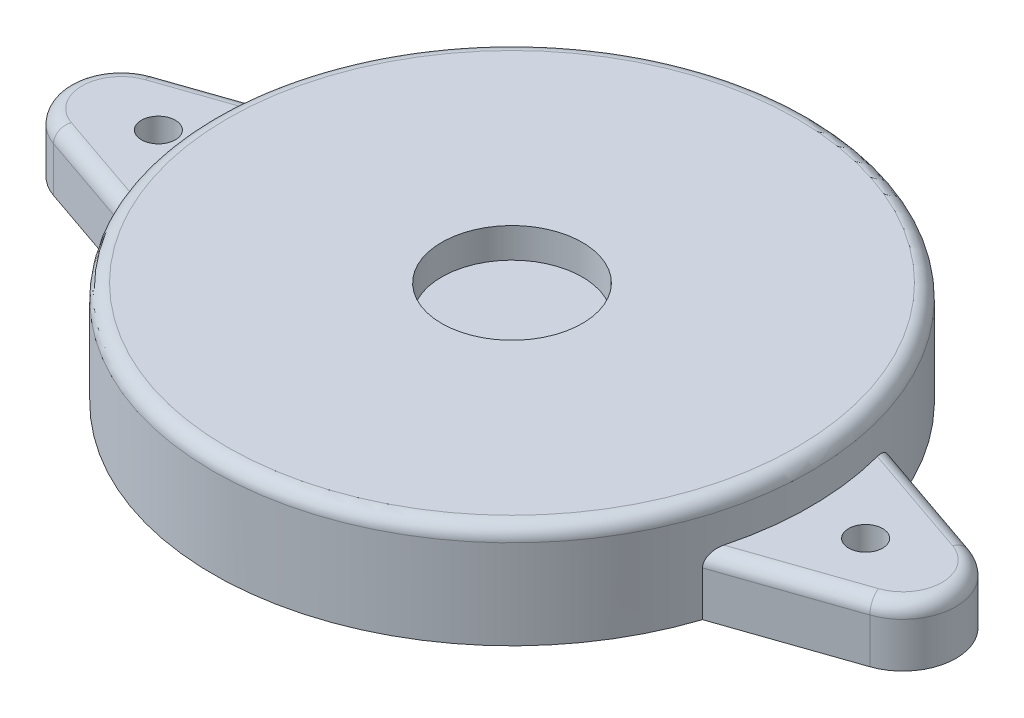
ISO-10303-21;
HEADER;
FILE_DESCRIPTION(('STEP AP214'),'2;1');
FILE_NAME('part.step','',(''),(''),'','','');
FILE_SCHEMA(('AUTOMOTIVE_DESIGN { 1 0 10303 214 1 1 1 1 }'));
ENDSEC;
DATA;
#1=APPLICATION_CONTEXT('core data for automotive mechanical design processes');
#2=APPLICATION_PROTOCOL_DEFINITION('international standard','automotive_design',2000,#1);
#3=PRODUCT_CONTEXT('',#1,'mechanical');
#4=PRODUCT('Part','Part','',(#3));
#5=PRODUCT_RELATED_PRODUCT_CATEGORY('part','',(#4));
#6=PRODUCT_DEFINITION_FORMATION('','',#4);
#7=PRODUCT_DEFINITION_CONTEXT('part definition',#1,'design');
#8=PRODUCT_DEFINITION('design','',#6,#7);
#9=PRODUCT_DEFINITION_SHAPE('','',#8);
#10=(LENGTH_UNIT() NAMED_UNIT(*) SI_UNIT(.MILLI.,.METRE.));
#11=(NAMED_UNIT(*) PLANE_ANGLE_UNIT() SI_UNIT($,.RADIAN.));
#12=(NAMED_UNIT(*) SI_UNIT($,.STERADIAN.) SOLID_ANGLE_UNIT());
#13=UNCERTAINTY_MEASURE_WITH_UNIT(LENGTH_MEASURE(1.E-05),#10,'distance_accuracy_value','');
#14=(GEOMETRIC_REPRESENTATION_CONTEXT(3) GLOBAL_UNCERTAINTY_ASSIGNED_CONTEXT((#13)) GLOBAL_UNIT_ASSIGNED_CONTEXT((#10,
#11,#12)) REPRESENTATION_CONTEXT('',''));
#15=CARTESIAN_POINT('',(0.,0.,0.));
#16=DIRECTION('',(0.,0.,1.));
#17=DIRECTION('',(1.,0.,0.));
#18=AXIS2_PLACEMENT_3D('',#15,#16,#17);
#19=CARTESIAN_POINT('',(0.,5.16,0.));
#20=DIRECTION('',(0.,-1.,0.));
#21=DIRECTION('',(0.,0.,-1.));
#22=AXIS2_PLACEMENT_3D('',#19,#20,#21);
#23=CYLINDRICAL_SURFACE('',#22,14.93);
#24=CARTESIAN_POINT('',(0.,4.46,0.));
#25=DIRECTION('',(0.,1.,0.));
#26=DIRECTION('',(0.,0.,1.));
#27=AXIS2_PLACEMENT_3D('',#24,#25,#26);
#28=CIRCLE('',#27,14.93);
#29=CARTESIAN_POINT('',(0.,4.46,14.93));
#30=VERTEX_POINT('',#29);
#31=EDGE_CURVE('E198',#30,#30,#28,.F.);
#32=ORIENTED_EDGE('',*,*,#31,.T.);
#33=EDGE_LOOP('',(#32));
#34=FACE_BOUND('',#33,.T.);
#35=CARTESIAN_POINT('',(0.,2.94,0.));
#36=DIRECTION('',(0.,-1.,0.));
#37=DIRECTION('',(0.,0.,-1.));
#38=AXIS2_PLACEMENT_3D('',#35,#36,#37);
#39=CIRCLE('',#38,14.93);
#40=CARTESIAN_POINT('',(-14.429087598297,2.94,3.8348834507287));
#41=VERTEX_POINT('',#40);
#42=CARTESIAN_POINT('',(-14.429087598297,2.94,-3.8348834507287));
#43=VERTEX_POINT('',#42);
#44=EDGE_CURVE('E159',#41,#43,#39,.T.);
#45=ORIENTED_EDGE('',*,*,#44,.F.);
#46=CARTESIAN_POINT('',(-14.429087598297,2.94,3.8348834507287));
#47=CARTESIAN_POINT('',(-14.4138774173166,2.93997814055828,3.8921743099573));
#48=CARTESIAN_POINT('',(-14.3982845537592,2.93480887956589,3.94941011262203));
#49=CARTESIAN_POINT('',(-14.3667965768096,2.91417210982097,4.06243771924972));
#50=CARTESIAN_POINT('',(-14.3509000239146,2.89861824672489,4.11821330467232));
#51=CARTESIAN_POINT('',(-14.3202531008862,2.85814754029159,4.22352402585155));
#52=CARTESIAN_POINT('',(-14.305483406981,2.83368591733759,4.2732273044714));
#53=CARTESIAN_POINT('',(-14.2771239902179,2.77541682636606,4.3670362653395));
#54=CARTESIAN_POINT('',(-14.2635295644546,2.74164911083228,4.41116461783673));
#55=CARTESIAN_POINT('',(-14.242478513252,2.67726120224456,4.47856390047529));
#56=CARTESIAN_POINT('',(-14.2344480605328,2.64907861241899,4.50399564814046));
#57=CARTESIAN_POINT('',(-14.219760478293,2.58871728969254,4.5501534800078));
#58=CARTESIAN_POINT('',(-14.2131033739341,2.5565384835928,4.57087947799488));
#59=CARTESIAN_POINT('',(-14.2015511147571,2.48845281904667,4.60664798740863));
#60=CARTESIAN_POINT('',(-14.1966728144079,2.45251425129202,4.6216361955794));
#61=CARTESIAN_POINT('',(-14.1892028208415,2.37825680983918,4.64452074193722));
#62=CARTESIAN_POINT('',(-14.1866043877521,2.33994531310194,4.65243798496127));
#63=CARTESIAN_POINT('',(-14.1849214181625,2.29108472920955,4.6575642029491));
#64=CARTESIAN_POINT('',(-14.1846584788022,2.28087987559489,4.6583649206828));
#65=CARTESIAN_POINT('',(-14.1843080413889,2.26045175313608,4.65943195312917));
#66=CARTESIAN_POINT('',(-14.184220329351,2.25022852203119,4.659698919651));
#67=CARTESIAN_POINT('',(-14.1842199529482,2.24,4.65970002536481));
#68=B_SPLINE_CURVE_WITH_KNOTS('',3,(#46,#47,#48,#49,#50,#51,#52,#53,#54,#55,#56,#57,#58,#59,#60,
#61,#62,#63,#64,#65,#66,#67),.UNSPECIFIED.,.F.,.F.,(4,2,2,2,2,2,2,2,2,2,4),(0.,
0.177689420451845,0.356875152519502,0.527957754312332,0.698320583460933,0.814287444919781,
0.930256430862166,1.04729732013803,1.16399102929701,1.19469972106421,1.22537088886555),.UNSPECIFIED.);
#69=CARTESIAN_POINT('',(-14.1842199529482,2.24,4.65970002536481));
#70=VERTEX_POINT('',#69);
#71=EDGE_CURVE('E42',#41,#70,#68,.T.);
#72=ORIENTED_EDGE('',*,*,#71,.T.);
#73=DIRECTION('',(0.,-1.,0.));
#74=VECTOR('',#73,1.);
#75=CARTESIAN_POINT('',(-14.1842199529482,2.94,4.65970002536481));
#76=LINE('',#75,#74);
#77=CARTESIAN_POINT('',(-14.1842199529482,0.,4.65970002536481));
#78=VERTEX_POINT('',#77);
#79=EDGE_CURVE('E134',#70,#78,#76,.T.);
#80=ORIENTED_EDGE('',*,*,#79,.T.);
#81=CARTESIAN_POINT('',(0.,0.,0.));
#82=DIRECTION('',(0.,1.,0.));
#83=DIRECTION('',(0.,0.,1.));
#84=AXIS2_PLACEMENT_3D('',#81,#82,#83);
#85=CIRCLE('',#84,14.93);
#86=CARTESIAN_POINT('',(14.1842199529483,0.,4.65970002536481));
#87=VERTEX_POINT('',#86);
#88=EDGE_CURVE('E146',#78,#87,#85,.T.);
#89=ORIENTED_EDGE('',*,*,#88,.T.);
#90=DIRECTION('',(0.,-1.,0.));
#91=VECTOR('',#90,1.);
#92=CARTESIAN_POINT('',(14.1842199529482,2.94,4.65970002536481));
#93=LINE('',#92,#91);
#94=CARTESIAN_POINT('',(14.1842199529482,2.24,4.65970002536481));
#95=VERTEX_POINT('',#94);
#96=EDGE_CURVE('E190',#95,#87,#93,.T.);
#97=ORIENTED_EDGE('',*,*,#96,.F.);
#98=CARTESIAN_POINT('',(14.1842199529482,2.24,4.65970002536481));
#99=CARTESIAN_POINT('',(14.1842190896717,2.25693649452195,4.65970201646287));
#100=CARTESIAN_POINT('',(14.184461026523,2.27386343904716,4.6589662491817));
#101=CARTESIAN_POINT('',(14.1854202016541,2.30756925031859,4.65604524308534));
#102=CARTESIAN_POINT('',(14.1861371831797,2.32434819209661,4.65386078726296));
#103=CARTESIAN_POINT('',(14.1889722437595,2.37406195090137,4.64521313316511));
#104=CARTESIAN_POINT('',(14.1917747600945,2.40661629321092,4.63665481022352));
#105=CARTESIAN_POINT('',(14.1989974675529,2.46965652039576,4.61448848816677));
#106=CARTESIAN_POINT('',(14.2034147720633,2.50014598190755,4.60088949919917));
#107=CARTESIAN_POINT('',(14.2135990146769,2.55856601677584,4.5693300993658));
#108=CARTESIAN_POINT('',(14.219367887,2.58649284229407,4.55136343655123));
#109=CARTESIAN_POINT('',(14.2324496611259,2.64139553893826,4.5102964837884));
#110=CARTESIAN_POINT('',(14.239847031579,2.66813434631393,4.48690821546017));
#111=CARTESIAN_POINT('',(14.255543759827,2.71792964715898,4.4367851705581));
#112=CARTESIAN_POINT('',(14.2638433119251,2.74098534474529,4.41004967290192));
#113=CARTESIAN_POINT('',(14.282757982286,2.78748441236427,4.34844257702542));
#114=CARTESIAN_POINT('',(14.2935083015561,2.81011977276594,4.3130029102126));
#115=CARTESIAN_POINT('',(14.3155306560991,2.84999580013863,4.23933536231764));
#116=CARTESIAN_POINT('',(14.326803306577,2.86722991003768,4.2011041611923));
#117=CARTESIAN_POINT('',(14.3516786781012,2.89899127627244,4.11540518367075));
#118=CARTESIAN_POINT('',(14.3653248558078,2.91241908179589,4.06754191138568));
#119=CARTESIAN_POINT('',(14.3924909249222,2.93160860206077,3.97034534492567));
#120=CARTESIAN_POINT('',(14.4060109908642,2.93738324223114,3.92101467352165));
#121=CARTESIAN_POINT('',(14.4225769534227,2.9397641173255,3.85931833082634));
#122=CARTESIAN_POINT('',(14.4258406872819,2.94000004110343,3.8471010798203));
#123=CARTESIAN_POINT('',(14.429087598297,2.94,3.8348834507287));
#124=B_SPLINE_CURVE_WITH_KNOTS('',3,(#98,#99,#100,#101,#102,#103,#104,#105,#106,#107,#108,#109,
#110,#111,#112,#113,#114,#115,#116,#117,#118,#119,#120,#121,#122,#123),.UNSPECIFIED.,.F.,.F.,(4,
2,2,2,2,2,2,2,2,2,2,2,4),(0.,0.0507734722109093,0.101519524519104,0.202294433131119,
0.302890069371643,0.403630556349275,0.512094664936698,0.620582179917424,0.750311736923561,
0.880198179861179,1.03423986539473,1.18802105701897,1.22595505623296),.UNSPECIFIED.);
#125=CARTESIAN_POINT('',(14.429087598297,2.94,3.8348834507287));
#126=VERTEX_POINT('',#125);
#127=EDGE_CURVE('E11',#95,#126,#124,.T.);
#128=ORIENTED_EDGE('',*,*,#127,.T.);
#129=CARTESIAN_POINT('',(0.,2.94,0.));
#130=DIRECTION('',(0.,-1.,0.));
#131=DIRECTION('',(0.,0.,1.));
#132=AXIS2_PLACEMENT_3D('',#129,#130,#131);
#133=CIRCLE('',#132,14.93);
#134=CARTESIAN_POINT('',(14.429087598297,2.94,-3.8348834507287));
#135=VERTEX_POINT('',#134);
#136=EDGE_CURVE('E173',#135,#126,#133,.T.);
#137=ORIENTED_EDGE('',*,*,#136,.F.);
#138=CARTESIAN_POINT('',(14.429087598297,2.94,-3.8348834507287));
#139=CARTESIAN_POINT('',(14.4138774173166,2.93997814055828,-3.8921743099573));
#140=CARTESIAN_POINT('',(14.3982845537592,2.93480887956589,-3.94941011262203));
#141=CARTESIAN_POINT('',(14.3667965768096,2.91417210982097,-4.06243771924972));
#142=CARTESIAN_POINT('',(14.3509000239146,2.89861824672489,-4.11821330467232));
#143=CARTESIAN_POINT('',(14.3202531008862,2.85814754029159,-4.22352402585155));
#144=CARTESIAN_POINT('',(14.305483406981,2.83368591733758,-4.2732273044714));
#145=CARTESIAN_POINT('',(14.2771239902179,2.77541682636606,-4.3670362653395));
#146=CARTESIAN_POINT('',(14.2635295644546,2.74164911083227,-4.41116461783674));
#147=CARTESIAN_POINT('',(14.242478513252,2.67726120224456,-4.47856390047529));
#148=CARTESIAN_POINT('',(14.2344480605328,2.64907861241899,-4.50399564814046));
#149=CARTESIAN_POINT('',(14.219760478293,2.58871728969254,-4.5501534800078));
#150=CARTESIAN_POINT('',(14.2131033739341,2.5565384835928,-4.57087947799488));
#151=CARTESIAN_POINT('',(14.2015511147571,2.48845281904666,-4.60664798740864));
#152=CARTESIAN_POINT('',(14.1966728144079,2.45251425129201,-4.6216361955794));
#153=CARTESIAN_POINT('',(14.1892028208415,2.37825680983918,-4.64452074193722));
#154=CARTESIAN_POINT('',(14.1866043877521,2.33994531310193,-4.65243798496127));
#155=CARTESIAN_POINT('',(14.1849214181625,2.29108472920955,-4.6575642029491));
#156=CARTESIAN_POINT('',(14.1846584788022,2.28087987559489,-4.6583649206828));
#157=CARTESIAN_POINT('',(14.1843080413889,2.26045175313608,-4.65943195312917));
#158=CARTESIAN_POINT('',(14.184220329351,2.25022852203119,-4.659698919651));
#159=CARTESIAN_POINT('',(14.1842199529482,2.24,-4.65970002536481));
#160=B_SPLINE_CURVE_WITH_KNOTS('',3,(#138,#139,#140,#141,#142,#143,#144,#145,#146,#147,#148,
#149,#150,#151,#152,#153,#154,#155,#156,#157,#158,#159),.UNSPECIFIED.,.F.,.F.,(4,2,2,2,2,2,2,2,
2,2,4),(0.,0.177689420451847,0.356875152519503,0.527957754312334,0.698320583460934,
0.814287444919785,0.930256430862171,1.04729732013804,1.16399102929701,1.19469972106422,
1.22537088886555),.UNSPECIFIED.);
#161=CARTESIAN_POINT('',(14.1842199529482,2.24,-4.65970002536481));
#162=VERTEX_POINT('',#161);
#163=EDGE_CURVE('E233',#135,#162,#160,.T.);
#164=ORIENTED_EDGE('',*,*,#163,.T.);
#165=DIRECTION('',(0.,-1.,0.));
#166=VECTOR('',#165,1.);
#167=CARTESIAN_POINT('',(14.1842199529482,2.94,-4.65970002536481));
#168=LINE('',#167,#166);
#169=CARTESIAN_POINT('',(14.1842199529482,0.,-4.65970002536481));
#170=VERTEX_POINT('',#169);
#171=EDGE_CURVE('E176',#162,#170,#168,.T.);
#172=ORIENTED_EDGE('',*,*,#171,.T.);
#173=CARTESIAN_POINT('',(-14.1842199529483,0.,-4.65970002536481));
#174=VERTEX_POINT('',#173);
#175=EDGE_CURVE('E192',#170,#174,#85,.T.);
#176=ORIENTED_EDGE('',*,*,#175,.T.);
#177=DIRECTION('',(0.,-1.,0.));
#178=VECTOR('',#177,1.);
#179=CARTESIAN_POINT('',(-14.1842199529482,2.94,-4.65970002536481));
#180=LINE('',#179,#178);
#181=CARTESIAN_POINT('',(-14.1842199529482,2.24,-4.65970002536481));
#182=VERTEX_POINT('',#181);
#183=EDGE_CURVE('E164',#182,#174,#180,.T.);
#184=ORIENTED_EDGE('',*,*,#183,.F.);
#185=CARTESIAN_POINT('',(-14.1842199529482,2.24,-4.65970002536481));
#186=CARTESIAN_POINT('',(-14.1842190896717,2.25693649452195,-4.65970201646287));
#187=CARTESIAN_POINT('',(-14.184461026523,2.27386343904716,-4.6589662491817));
#188=CARTESIAN_POINT('',(-14.1854202016541,2.30756925031859,-4.65604524308534));
#189=CARTESIAN_POINT('',(-14.1861371831797,2.32434819209661,-4.65386078726296));
#190=CARTESIAN_POINT('',(-14.1889722437595,2.37406195090137,-4.64521313316511));
#191=CARTESIAN_POINT('',(-14.1917747600945,2.40661629321092,-4.63665481022352));
#192=CARTESIAN_POINT('',(-14.1989974675529,2.46965652039576,-4.61448848816677));
#193=CARTESIAN_POINT('',(-14.2034147720633,2.50014598190755,-4.60088949919916));
#194=CARTESIAN_POINT('',(-14.2135990146769,2.55856601677584,-4.5693300993658));
#195=CARTESIAN_POINT('',(-14.219367887,2.58649284229407,-4.55136343655123));
#196=CARTESIAN_POINT('',(-14.2324496611259,2.64139553893826,-4.5102964837884));
#197=CARTESIAN_POINT('',(-14.239847031579,2.66813434631393,-4.48690821546017));
#198=CARTESIAN_POINT('',(-14.255543759827,2.71792964715898,-4.4367851705581));
#199=CARTESIAN_POINT('',(-14.2638433119251,2.74098534474529,-4.41004967290191));
#200=CARTESIAN_POINT('',(-14.282757982286,2.78748441236427,-4.34844257702541));
#201=CARTESIAN_POINT('',(-14.2935083015561,2.81011977276594,-4.3130029102126));
#202=CARTESIAN_POINT('',(-14.3155306560991,2.84999580013863,-4.23933536231764));
#203=CARTESIAN_POINT('',(-14.326803306577,2.86722991003768,-4.2011041611923));
#204=CARTESIAN_POINT('',(-14.3516786781012,2.89899127627244,-4.11540518367075));
#205=CARTESIAN_POINT('',(-14.3653248558078,2.91241908179589,-4.06754191138568));
#206=CARTESIAN_POINT('',(-14.3924909249222,2.93160860206077,-3.97034534492567));
#207=CARTESIAN_POINT('',(-14.4060109908642,2.93738324223114,-3.92101467352165));
#208=CARTESIAN_POINT('',(-14.4225769534227,2.9397641173255,-3.85931833082634));
#209=CARTESIAN_POINT('',(-14.4258406872819,2.94000004110343,-3.8471010798203));
#210=CARTESIAN_POINT('',(-14.429087598297,2.94,-3.8348834507287));
#211=B_SPLINE_CURVE_WITH_KNOTS('',3,(#185,#186,#187,#188,#189,#190,#191,#192,#193,#194,#195,
#196,#197,#198,#199,#200,#201,#202,#203,#204,#205,#206,#207,#208,#209,#210),.UNSPECIFIED.,.F.,
.F.,(4,2,2,2,2,2,2,2,2,2,2,2,4),(0.,0.0507734722109094,0.101519524519103,0.202294433131119,
0.302890069371642,0.403630556349275,0.512094664936698,0.620582179917423,0.75031173692356,
0.880198179861176,1.03423986539473,1.18802105701897,1.22595505623296),.UNSPECIFIED.);
#212=EDGE_CURVE('E225',#182,#43,#211,.T.);
#213=ORIENTED_EDGE('',*,*,#212,.T.);
#214=EDGE_LOOP('',(#45,#72,#80,#89,#97,#128,#137,#164,#172,#176,#184,#213));
#215=FACE_BOUND('',#214,.T.);
#216=ADVANCED_FACE('F32',(#34,#215),#23,.T.);
#217=CARTESIAN_POINT('',(0.,5.16,0.));
#218=DIRECTION('',(0.,1.,0.));
#219=DIRECTION('',(0.,0.,1.));
#220=AXIS2_PLACEMENT_3D('',#217,#218,#219);
#221=PLANE('',#220);
#222=CARTESIAN_POINT('',(0.,5.16,0.));
#223=DIRECTION('',(0.,1.,0.));
#224=DIRECTION('',(0.,0.,1.));
#225=AXIS2_PLACEMENT_3D('',#222,#223,#224);
#226=CIRCLE('',#225,3.515);
#227=CARTESIAN_POINT('',(0.,5.16,3.515));
#228=VERTEX_POINT('',#227);
#229=EDGE_CURVE('E281',#228,#228,#226,.T.);
#230=ORIENTED_EDGE('',*,*,#229,.F.);
#231=EDGE_LOOP('',(#230));
#232=FACE_BOUND('',#231,.T.);
#233=CARTESIAN_POINT('',(0.,5.16,0.));
#234=DIRECTION('',(0.,1.,0.));
#235=DIRECTION('',(0.,0.,1.));
#236=AXIS2_PLACEMENT_3D('',#233,#234,#235);
#237=CIRCLE('',#236,14.23);
#238=CARTESIAN_POINT('',(0.,5.16,14.23));
#239=VERTEX_POINT('',#238);
#240=EDGE_CURVE('E195',#239,#239,#237,.T.);
#241=ORIENTED_EDGE('',*,*,#240,.T.);
#242=EDGE_LOOP('',(#241));
#243=FACE_BOUND('',#242,.T.);
#244=ADVANCED_FACE('F306',(#232,#243),#221,.T.);
#245=CARTESIAN_POINT('',(0.,0.,0.));
#246=DIRECTION('',(0.,1.,0.));
#247=DIRECTION('',(0.,0.,1.));
#248=AXIS2_PLACEMENT_3D('',#245,#246,#247);
#249=PLANE('',#248);
#250=ORIENTED_EDGE('',*,*,#175,.F.);
#251=DIRECTION('',(-0.945415498264678,0.,-0.325867358968263));
#252=VECTOR('',#251,1.);
#253=CARTESIAN_POINT('',(14.1842199529482,0.,-4.65970002536481));
#254=LINE('',#253,#252);
#255=CARTESIAN_POINT('',(20.4067284526636,0.,-2.51491562667268));
#256=VERTEX_POINT('',#255);
#257=EDGE_CURVE('E177',#256,#170,#254,.T.);
#258=ORIENTED_EDGE('',*,*,#257,.F.);
#259=CARTESIAN_POINT('',(19.5398832245115,0.,0.));
#260=DIRECTION('',(0.,1.,0.));
#261=DIRECTION('',(0.,0.,1.));
#262=AXIS2_PLACEMENT_3D('',#259,#260,#261);
#263=CIRCLE('',#262,2.66011677541656);
#264=CARTESIAN_POINT('',(20.4067284526636,0.,2.51491562667268));
#265=VERTEX_POINT('',#264);
#266=EDGE_CURVE('E180',#265,#256,#263,.T.);
#267=ORIENTED_EDGE('',*,*,#266,.F.);
#268=DIRECTION('',(0.945415498264678,0.,-0.325867358968263));
#269=VECTOR('',#268,1.);
#270=CARTESIAN_POINT('',(14.1842199529482,0.,4.65970002536481));
#271=LINE('',#270,#269);
#272=EDGE_CURVE('E170',#87,#265,#271,.T.);
#273=ORIENTED_EDGE('',*,*,#272,.F.);
#274=ORIENTED_EDGE('',*,*,#88,.F.);
#275=DIRECTION('',(0.945415498264678,0.,0.325867358968263));
#276=VECTOR('',#275,1.);
#277=CARTESIAN_POINT('',(-14.1842199529482,0.,4.65970002536481));
#278=LINE('',#277,#276);
#279=CARTESIAN_POINT('',(-20.4067284526636,0.,2.51491562667268));
#280=VERTEX_POINT('',#279);
#281=EDGE_CURVE('E127',#280,#78,#278,.T.);
#282=ORIENTED_EDGE('',*,*,#281,.F.);
#283=CARTESIAN_POINT('',(-19.5398832245115,0.,0.));
#284=DIRECTION('',(0.,1.,0.));
#285=DIRECTION('',(0.,0.,-1.));
#286=AXIS2_PLACEMENT_3D('',#283,#284,#285);
#287=CIRCLE('',#286,2.66011677541656);
#288=CARTESIAN_POINT('',(-20.4067284526636,0.,-2.51491562667268));
#289=VERTEX_POINT('',#288);
#290=EDGE_CURVE('E143',#289,#280,#287,.T.);
#291=ORIENTED_EDGE('',*,*,#290,.F.);
#292=DIRECTION('',(-0.945415498264678,0.,0.325867358968263));
#293=VECTOR('',#292,1.);
#294=CARTESIAN_POINT('',(-14.1842199529482,0.,-4.65970002536481));
#295=LINE('',#294,#293);
#296=EDGE_CURVE('E147',#174,#289,#295,.T.);
#297=ORIENTED_EDGE('',*,*,#296,.F.);
#298=EDGE_LOOP('',(#250,#258,#267,#273,#274,#282,#291,#297));
#299=FACE_BOUND('',#298,.T.);
#300=CARTESIAN_POINT('',(17.679999999928,0.,0.));
#301=DIRECTION('',(0.,1.,0.));
#302=DIRECTION('',(0.,0.,1.));
#303=AXIS2_PLACEMENT_3D('',#300,#301,#302);
#304=CIRCLE('',#303,0.85);
#305=CARTESIAN_POINT('',(17.679999999928,0.,0.85));
#306=VERTEX_POINT('',#305);
#307=EDGE_CURVE('E133',#306,#306,#304,.T.);
#308=ORIENTED_EDGE('',*,*,#307,.T.);
#309=EDGE_LOOP('',(#308));
#310=FACE_BOUND('',#309,.T.);
#311=CARTESIAN_POINT('',(-17.679999999928,0.,0.));
#312=DIRECTION('',(0.,1.,0.));
#313=DIRECTION('',(0.,0.,-1.));
#314=AXIS2_PLACEMENT_3D('',#311,#312,#313);
#315=CIRCLE('',#314,0.85);
#316=CARTESIAN_POINT('',(-17.679999999928,0.,-0.849999999999999));
#317=VERTEX_POINT('',#316);
#318=EDGE_CURVE('E156',#317,#317,#315,.T.);
#319=ORIENTED_EDGE('',*,*,#318,.T.);
#320=EDGE_LOOP('',(#319));
#321=FACE_BOUND('',#320,.T.);
#322=ADVANCED_FACE('F140',(#299,#310,#321),#249,.F.);
#323=CARTESIAN_POINT('',(0.,2.94,0.));
#324=DIRECTION('',(0.,1.,0.));
#325=DIRECTION('',(0.,0.,1.));
#326=AXIS2_PLACEMENT_3D('',#323,#324,#325);
#327=PLANE('',#326);
#328=CARTESIAN_POINT('',(19.5398832245115,2.94,0.));
#329=DIRECTION('',(0.,1.,0.));
#330=DIRECTION('',(0.,0.,1.));
#331=AXIS2_PLACEMENT_3D('',#328,#329,#330);
#332=CIRCLE('',#331,1.96011677541656);
#333=CARTESIAN_POINT('',(20.1786213013859,2.94,1.8531247778874));
#334=VERTEX_POINT('',#333);
#335=CARTESIAN_POINT('',(20.1786213013859,2.94,-1.8531247778874));
#336=VERTEX_POINT('',#335);
#337=EDGE_CURVE('E214',#334,#336,#332,.T.);
#338=ORIENTED_EDGE('',*,*,#337,.T.);
#339=DIRECTION('',(-0.945415498264678,0.,-0.325867358968263));
#340=VECTOR('',#339,1.);
#341=CARTESIAN_POINT('',(13.9561128016705,2.94,-3.99790917657953));
#342=LINE('',#341,#340);
#343=EDGE_CURVE('E216',#336,#135,#342,.T.);
#344=ORIENTED_EDGE('',*,*,#343,.T.);
#345=ORIENTED_EDGE('',*,*,#136,.T.);
#346=DIRECTION('',(0.945415498264678,0.,-0.325867358968263));
#347=VECTOR('',#346,1.);
#348=CARTESIAN_POINT('',(20.1786213013859,2.94,1.8531247778874));
#349=LINE('',#348,#347);
#350=EDGE_CURVE('E212',#126,#334,#349,.T.);
#351=ORIENTED_EDGE('',*,*,#350,.T.);
#352=EDGE_LOOP('',(#338,#344,#345,#351));
#353=FACE_BOUND('',#352,.T.);
#354=CARTESIAN_POINT('',(17.679999999928,2.94,0.));
#355=DIRECTION('',(0.,1.,0.));
#356=DIRECTION('',(0.,0.,1.));
#357=AXIS2_PLACEMENT_3D('',#354,#355,#356);
#358=CIRCLE('',#357,0.85);
#359=CARTESIAN_POINT('',(17.679999999928,2.94,0.85));
#360=VERTEX_POINT('',#359);
#361=EDGE_CURVE('E167',#360,#360,#358,.T.);
#362=ORIENTED_EDGE('',*,*,#361,.F.);
#363=EDGE_LOOP('',(#362));
#364=FACE_BOUND('',#363,.T.);
#365=ADVANCED_FACE('F340',(#353,#364),#327,.T.);
#366=CARTESIAN_POINT('',(14.1842199529482,2.94,4.65970002536481));
#367=DIRECTION('',(-0.325867358968263,0.,-0.945415498264678));
#368=DIRECTION('',(-0.945415498264678,0.,0.325867358968263));
#369=AXIS2_PLACEMENT_3D('',#366,#367,#368);
#370=PLANE('',#369);
#371=DIRECTION('',(0.,-1.,0.));
#372=VECTOR('',#371,1.);
#373=CARTESIAN_POINT('',(20.4067284526636,2.94,2.51491562667268));
#374=LINE('',#373,#372);
#375=CARTESIAN_POINT('',(20.4067284526636,2.24,2.51491562667268));
#376=VERTEX_POINT('',#375);
#377=EDGE_CURVE('E188',#376,#265,#374,.T.);
#378=ORIENTED_EDGE('',*,*,#377,.F.);
#379=DIRECTION('',(0.945415498264678,0.,-0.325867358968263));
#380=VECTOR('',#379,1.);
#381=CARTESIAN_POINT('',(14.1842199529482,2.24,4.65970002536481));
#382=LINE('',#381,#380);
#383=EDGE_CURVE('E50',#376,#95,#382,.F.);
#384=ORIENTED_EDGE('',*,*,#383,.T.);
#385=ORIENTED_EDGE('',*,*,#96,.T.);
#386=ORIENTED_EDGE('',*,*,#272,.T.);
#387=EDGE_LOOP('',(#378,#384,#385,#386));
#388=FACE_BOUND('',#387,.T.);
#389=ADVANCED_FACE('F343',(#388),#370,.F.);
#390=CARTESIAN_POINT('',(19.5398832245115,2.94,0.));
#391=DIRECTION('',(0.,-1.,0.));
#392=DIRECTION('',(0.,0.,-1.));
#393=AXIS2_PLACEMENT_3D('',#390,#391,#392);
#394=CYLINDRICAL_SURFACE('',#393,2.66011677541656);
#395=DIRECTION('',(0.,-1.,0.));
#396=VECTOR('',#395,1.);
#397=CARTESIAN_POINT('',(20.4067284526636,2.94,-2.51491562667268));
#398=LINE('',#397,#396);
#399=CARTESIAN_POINT('',(20.4067284526636,2.24,-2.51491562667268));
#400=VERTEX_POINT('',#399);
#401=EDGE_CURVE('E186',#400,#256,#398,.T.);
#402=ORIENTED_EDGE('',*,*,#401,.F.);
#403=CARTESIAN_POINT('',(19.5398832245115,2.24,0.));
#404=DIRECTION('',(0.,1.,0.));
#405=DIRECTION('',(0.,0.,1.));
#406=AXIS2_PLACEMENT_3D('',#403,#404,#405);
#407=CIRCLE('',#406,2.66011677541656);
#408=EDGE_CURVE('E221',#400,#376,#407,.F.);
#409=ORIENTED_EDGE('',*,*,#408,.T.);
#410=ORIENTED_EDGE('',*,*,#377,.T.);
#411=ORIENTED_EDGE('',*,*,#266,.T.);
#412=EDGE_LOOP('',(#402,#409,#410,#411));
#413=FACE_BOUND('',#412,.T.);
#414=ADVANCED_FACE('F347',(#413),#394,.T.);
#415=CARTESIAN_POINT('',(14.1842199529482,2.94,-4.65970002536481));
#416=DIRECTION('',(-0.325867358968263,0.,0.945415498264678));
#417=DIRECTION('',(0.945415498264678,0.,0.325867358968263));
#418=AXIS2_PLACEMENT_3D('',#415,#416,#417);
#419=PLANE('',#418);
#420=ORIENTED_EDGE('',*,*,#171,.F.);
#421=DIRECTION('',(-0.945415498264678,0.,-0.325867358968263));
#422=VECTOR('',#421,1.);
#423=CARTESIAN_POINT('',(20.4067284526636,2.24,-2.51491562667268));
#424=LINE('',#423,#422);
#425=EDGE_CURVE('E219',#162,#400,#424,.F.);
#426=ORIENTED_EDGE('',*,*,#425,.T.);
#427=ORIENTED_EDGE('',*,*,#401,.T.);
#428=ORIENTED_EDGE('',*,*,#257,.T.);
#429=EDGE_LOOP('',(#420,#426,#427,#428));
#430=FACE_BOUND('',#429,.T.);
#431=ADVANCED_FACE('F334',(#430),#419,.F.);
#432=CARTESIAN_POINT('',(17.679999999928,2.94,0.));
#433=DIRECTION('',(0.,-1.,0.));
#434=DIRECTION('',(0.,0.,-1.));
#435=AXIS2_PLACEMENT_3D('',#432,#433,#434);
#436=CYLINDRICAL_SURFACE('',#435,0.85);
#437=ORIENTED_EDGE('',*,*,#361,.T.);
#438=EDGE_LOOP('',(#437));
#439=FACE_BOUND('',#438,.T.);
#440=ORIENTED_EDGE('',*,*,#307,.F.);
#441=EDGE_LOOP('',(#440));
#442=FACE_BOUND('',#441,.T.);
#443=ADVANCED_FACE('F327',(#439,#442),#436,.F.);
#444=CARTESIAN_POINT('',(-19.5398832245115,2.94,0.));
#445=DIRECTION('',(0.,-1.,0.));
#446=DIRECTION('',(0.,0.,-1.));
#447=AXIS2_PLACEMENT_3D('',#444,#445,#446);
#448=PLANE('',#447);
#449=ORIENTED_EDGE('',*,*,#44,.T.);
#450=DIRECTION('',(-0.945415498264678,0.,0.325867358968263));
#451=VECTOR('',#450,1.);
#452=CARTESIAN_POINT('',(-20.1786213013859,2.94,-1.8531247778874));
#453=LINE('',#452,#451);
#454=CARTESIAN_POINT('',(-20.1786213013859,2.94,-1.8531247778874));
#455=VERTEX_POINT('',#454);
#456=EDGE_CURVE('E205',#43,#455,#453,.T.);
#457=ORIENTED_EDGE('',*,*,#456,.T.);
#458=CARTESIAN_POINT('',(-19.5398832245115,2.94,0.));
#459=DIRECTION('',(0.,-1.,0.));
#460=DIRECTION('',(0.,0.,-1.));
#461=AXIS2_PLACEMENT_3D('',#458,#459,#460);
#462=CIRCLE('',#461,1.96011677541656);
#463=CARTESIAN_POINT('',(-20.1786213013859,2.94,1.8531247778874));
#464=VERTEX_POINT('',#463);
#465=EDGE_CURVE('E203',#455,#464,#462,.F.);
#466=ORIENTED_EDGE('',*,*,#465,.T.);
#467=DIRECTION('',(0.945415498264678,0.,0.325867358968263));
#468=VECTOR('',#467,1.);
#469=CARTESIAN_POINT('',(-20.1786213013859,2.94,1.8531247778874));
#470=LINE('',#469,#468);
#471=EDGE_CURVE('E201',#464,#41,#470,.T.);
#472=ORIENTED_EDGE('',*,*,#471,.T.);
#473=EDGE_LOOP('',(#449,#457,#466,#472));
#474=FACE_BOUND('',#473,.T.);
#475=CARTESIAN_POINT('',(-17.679999999928,2.94,0.));
#476=DIRECTION('',(0.,1.,0.));
#477=DIRECTION('',(0.,0.,-1.));
#478=AXIS2_PLACEMENT_3D('',#475,#476,#477);
#479=CIRCLE('',#478,0.85);
#480=CARTESIAN_POINT('',(-17.679999999928,2.94,-0.849999999999999));
#481=VERTEX_POINT('',#480);
#482=EDGE_CURVE('E153',#481,#481,#479,.T.);
#483=ORIENTED_EDGE('',*,*,#482,.F.);
#484=EDGE_LOOP('',(#483));
#485=FACE_BOUND('',#484,.T.);
#486=ADVANCED_FACE('F324',(#474,#485),#448,.F.);
#487=CARTESIAN_POINT('',(-19.5398832245115,2.94,0.));
#488=DIRECTION('',(0.,-1.,0.));
#489=DIRECTION('',(0.,0.,-1.));
#490=AXIS2_PLACEMENT_3D('',#487,#488,#489);
#491=CYLINDRICAL_SURFACE('',#490,2.66011677541656);
#492=DIRECTION('',(0.,-1.,0.));
#493=VECTOR('',#492,1.);
#494=CARTESIAN_POINT('',(-20.4067284526636,2.94,2.51491562667268));
#495=LINE('',#494,#493);
#496=CARTESIAN_POINT('',(-20.4067284526636,2.24,2.51491562667268));
#497=VERTEX_POINT('',#496);
#498=EDGE_CURVE('E124',#497,#280,#495,.T.);
#499=ORIENTED_EDGE('',*,*,#498,.F.);
#500=CARTESIAN_POINT('',(-19.5398832245115,2.24,0.));
#501=DIRECTION('',(0.,-1.,0.));
#502=DIRECTION('',(0.,0.,-1.));
#503=AXIS2_PLACEMENT_3D('',#500,#501,#502);
#504=CIRCLE('',#503,2.66011677541656);
#505=CARTESIAN_POINT('',(-20.4067284526636,2.24,-2.51491562667268));
#506=VERTEX_POINT('',#505);
#507=EDGE_CURVE('E210',#497,#506,#504,.T.);
#508=ORIENTED_EDGE('',*,*,#507,.T.);
#509=DIRECTION('',(0.,-1.,0.));
#510=VECTOR('',#509,1.);
#511=CARTESIAN_POINT('',(-20.4067284526636,2.94,-2.51491562667268));
#512=LINE('',#511,#510);
#513=EDGE_CURVE('E151',#506,#289,#512,.T.);
#514=ORIENTED_EDGE('',*,*,#513,.T.);
#515=ORIENTED_EDGE('',*,*,#290,.T.);
#516=EDGE_LOOP('',(#499,#508,#514,#515));
#517=FACE_BOUND('',#516,.T.);
#518=ADVANCED_FACE('F149',(#517),#491,.T.);
#519=CARTESIAN_POINT('',(-14.1842199529482,2.94,4.65970002536481));
#520=DIRECTION('',(0.325867358968263,0.,-0.945415498264678));
#521=DIRECTION('',(-0.945415498264678,0.,-0.325867358968263));
#522=AXIS2_PLACEMENT_3D('',#519,#520,#521);
#523=PLANE('',#522);
#524=ORIENTED_EDGE('',*,*,#79,.F.);
#525=DIRECTION('',(0.945415498264678,0.,0.325867358968263));
#526=VECTOR('',#525,1.);
#527=CARTESIAN_POINT('',(-14.1842199529482,2.24,4.65970002536481));
#528=LINE('',#527,#526);
#529=EDGE_CURVE('E129',#70,#497,#528,.F.);
#530=ORIENTED_EDGE('',*,*,#529,.T.);
#531=ORIENTED_EDGE('',*,*,#498,.T.);
#532=ORIENTED_EDGE('',*,*,#281,.T.);
#533=EDGE_LOOP('',(#524,#530,#531,#532));
#534=FACE_BOUND('',#533,.T.);
#535=ADVANCED_FACE('F126',(#534),#523,.F.);
#536=CARTESIAN_POINT('',(-14.1842199529482,2.94,-4.65970002536481));
#537=DIRECTION('',(0.325867358968263,0.,0.945415498264678));
#538=DIRECTION('',(0.945415498264678,0.,-0.325867358968263));
#539=AXIS2_PLACEMENT_3D('',#536,#537,#538);
#540=PLANE('',#539);
#541=ORIENTED_EDGE('',*,*,#513,.F.);
#542=DIRECTION('',(-0.945415498264678,0.,0.325867358968263));
#543=VECTOR('',#542,1.);
#544=CARTESIAN_POINT('',(-14.1842199529482,2.24,-4.65970002536481));
#545=LINE('',#544,#543);
#546=EDGE_CURVE('E208',#506,#182,#545,.F.);
#547=ORIENTED_EDGE('',*,*,#546,.T.);
#548=ORIENTED_EDGE('',*,*,#183,.T.);
#549=ORIENTED_EDGE('',*,*,#296,.T.);
#550=EDGE_LOOP('',(#541,#547,#548,#549));
#551=FACE_BOUND('',#550,.T.);
#552=ADVANCED_FACE('F293',(#551),#540,.F.);
#553=CARTESIAN_POINT('',(-17.679999999928,2.94,0.));
#554=DIRECTION('',(0.,-1.,0.));
#555=DIRECTION('',(0.,0.,-1.));
#556=AXIS2_PLACEMENT_3D('',#553,#554,#555);
#557=CYLINDRICAL_SURFACE('',#556,0.85);
#558=ORIENTED_EDGE('',*,*,#482,.T.);
#559=EDGE_LOOP('',(#558));
#560=FACE_BOUND('',#559,.T.);
#561=ORIENTED_EDGE('',*,*,#318,.F.);
#562=EDGE_LOOP('',(#561));
#563=FACE_BOUND('',#562,.T.);
#564=ADVANCED_FACE('F291',(#560,#563),#557,.F.);
#565=CARTESIAN_POINT('',(0.,4.46,0.));
#566=DIRECTION('',(0.,1.,0.));
#567=DIRECTION('',(0.,0.,1.));
#568=AXIS2_PLACEMENT_3D('',#565,#566,#567);
#569=TOROIDAL_SURFACE('',#568,14.23,0.7);
#570=ORIENTED_EDGE('',*,*,#31,.F.);
#571=EDGE_LOOP('',(#570));
#572=FACE_BOUND('',#571,.T.);
#573=ORIENTED_EDGE('',*,*,#240,.F.);
#574=EDGE_LOOP('',(#573));
#575=FACE_BOUND('',#574,.T.);
#576=ADVANCED_FACE('F249',(#572,#575),#569,.T.);
#577=CARTESIAN_POINT('',(-20.1786213013859,2.24,1.8531247778874));
#578=DIRECTION('',(0.945415498264678,0.,0.325867358968263));
#579=DIRECTION('',(0.325867358968263,0.,-0.945415498264678));
#580=AXIS2_PLACEMENT_3D('',#577,#578,#579);
#581=CYLINDRICAL_SURFACE('',#580,0.7);
#582=ORIENTED_EDGE('',*,*,#71,.F.);
#583=ORIENTED_EDGE('',*,*,#471,.F.);
#584=CARTESIAN_POINT('',(-20.1786213013859,2.24,1.8531247778874));
#585=DIRECTION('',(-0.945415498264678,0.,-0.325867358968262));
#586=DIRECTION('',(-0.325867358968262,0.,0.945415498264678));
#587=AXIS2_PLACEMENT_3D('',#584,#585,#586);
#588=CIRCLE('',#587,0.7);
#589=EDGE_CURVE('E270',#497,#464,#588,.T.);
#590=ORIENTED_EDGE('',*,*,#589,.F.);
#591=ORIENTED_EDGE('',*,*,#529,.F.);
#592=EDGE_LOOP('',(#582,#583,#590,#591));
#593=FACE_BOUND('',#592,.T.);
#594=ADVANCED_FACE('F252',(#593),#581,.T.);
#595=CARTESIAN_POINT('',(-19.5398832245115,2.24,0.));
#596=DIRECTION('',(0.,-1.,0.));
#597=DIRECTION('',(0.,0.,-1.));
#598=AXIS2_PLACEMENT_3D('',#595,#596,#597);
#599=TOROIDAL_SURFACE('',#598,1.96011677541656,0.7);
#600=ORIENTED_EDGE('',*,*,#589,.T.);
#601=ORIENTED_EDGE('',*,*,#465,.F.);
#602=CARTESIAN_POINT('',(-20.1786213013859,2.24,-1.8531247778874));
#603=DIRECTION('',(0.945415498264678,0.,-0.325867358968262));
#604=DIRECTION('',(-0.325867358968262,0.,-0.945415498264678));
#605=AXIS2_PLACEMENT_3D('',#602,#603,#604);
#606=CIRCLE('',#605,0.7);
#607=EDGE_CURVE('E268',#506,#455,#606,.T.);
#608=ORIENTED_EDGE('',*,*,#607,.F.);
#609=ORIENTED_EDGE('',*,*,#507,.F.);
#610=EDGE_LOOP('',(#600,#601,#608,#609));
#611=FACE_BOUND('',#610,.T.);
#612=ADVANCED_FACE('F247',(#611),#599,.T.);
#613=CARTESIAN_POINT('',(-20.1786213013859,2.24,-1.8531247778874));
#614=DIRECTION('',(-0.945415498264678,0.,0.325867358968263));
#615=DIRECTION('',(0.325867358968263,0.,0.945415498264678));
#616=AXIS2_PLACEMENT_3D('',#613,#614,#615);
#617=CYLINDRICAL_SURFACE('',#616,0.7);
#618=ORIENTED_EDGE('',*,*,#212,.F.);
#619=ORIENTED_EDGE('',*,*,#546,.F.);
#620=ORIENTED_EDGE('',*,*,#607,.T.);
#621=ORIENTED_EDGE('',*,*,#456,.F.);
#622=EDGE_LOOP('',(#618,#619,#620,#621));
#623=FACE_BOUND('',#622,.T.);
#624=ADVANCED_FACE('F243',(#623),#617,.T.);
#625=CARTESIAN_POINT('',(2.71366920296367,2.24,7.87297300892069));
#626=DIRECTION('',(-0.945415498264678,0.,0.325867358968263));
#627=DIRECTION('',(0.325867358968263,0.,0.945415498264678));
#628=AXIS2_PLACEMENT_3D('',#625,#626,#627);
#629=CYLINDRICAL_SURFACE('',#628,0.7);
#630=ORIENTED_EDGE('',*,*,#127,.F.);
#631=ORIENTED_EDGE('',*,*,#383,.F.);
#632=CARTESIAN_POINT('',(20.1786213013859,2.24,1.8531247778874));
#633=DIRECTION('',(0.945415498264678,0.,-0.325867358968263));
#634=DIRECTION('',(-0.325867358968263,0.,-0.945415498264678));
#635=AXIS2_PLACEMENT_3D('',#632,#633,#634);
#636=CIRCLE('',#635,0.7);
#637=EDGE_CURVE('E37',#334,#376,#636,.T.);
#638=ORIENTED_EDGE('',*,*,#637,.F.);
#639=ORIENTED_EDGE('',*,*,#350,.F.);
#640=EDGE_LOOP('',(#630,#631,#638,#639));
#641=FACE_BOUND('',#640,.T.);
#642=ADVANCED_FACE('F34',(#641),#629,.T.);
#643=CARTESIAN_POINT('',(19.5398832245115,2.24,0.));
#644=DIRECTION('',(0.,1.,0.));
#645=DIRECTION('',(0.,0.,1.));
#646=AXIS2_PLACEMENT_3D('',#643,#644,#645);
#647=TOROIDAL_SURFACE('',#646,1.96011677541656,0.7);
#648=ORIENTED_EDGE('',*,*,#637,.T.);
#649=ORIENTED_EDGE('',*,*,#408,.F.);
#650=CARTESIAN_POINT('',(20.1786213013859,2.24,-1.8531247778874));
#651=DIRECTION('',(-0.945415498264678,0.,-0.325867358968262));
#652=DIRECTION('',(-0.325867358968262,0.,0.945415498264678));
#653=AXIS2_PLACEMENT_3D('',#650,#651,#652);
#654=CIRCLE('',#653,0.7);
#655=EDGE_CURVE('E272',#336,#400,#654,.T.);
#656=ORIENTED_EDGE('',*,*,#655,.F.);
#657=ORIENTED_EDGE('',*,*,#337,.F.);
#658=EDGE_LOOP('',(#648,#649,#656,#657));
#659=FACE_BOUND('',#658,.T.);
#660=ADVANCED_FACE('F444',(#659),#647,.T.);
#661=CARTESIAN_POINT('',(2.71366920296367,2.24,-7.87297300892069));
#662=DIRECTION('',(0.945415498264678,0.,0.325867358968263));
#663=DIRECTION('',(0.325867358968263,0.,-0.945415498264678));
#664=AXIS2_PLACEMENT_3D('',#661,#662,#663);
#665=CYLINDRICAL_SURFACE('',#664,0.7);
#666=ORIENTED_EDGE('',*,*,#655,.T.);
#667=ORIENTED_EDGE('',*,*,#425,.F.);
#668=ORIENTED_EDGE('',*,*,#163,.F.);
#669=ORIENTED_EDGE('',*,*,#343,.F.);
#670=EDGE_LOOP('',(#666,#667,#668,#669));
#671=FACE_BOUND('',#670,.T.);
#672=ADVANCED_FACE('F257',(#671),#665,.T.);
#673=CARTESIAN_POINT('',(0.,3.66,0.));
#674=DIRECTION('',(0.,1.,0.));
#675=DIRECTION('',(0.,0.,1.));
#676=AXIS2_PLACEMENT_3D('',#673,#674,#675);
#677=CYLINDRICAL_SURFACE('',#676,3.515);
#678=CARTESIAN_POINT('',(0.,3.66,0.));
#679=DIRECTION('',(0.,1.,0.));
#680=DIRECTION('',(0.,0.,1.));
#681=AXIS2_PLACEMENT_3D('',#678,#679,#680);
#682=CIRCLE('',#681,3.515);
#683=CARTESIAN_POINT('',(0.,3.66,3.515));
#684=VERTEX_POINT('',#683);
#685=EDGE_CURVE('E274',#684,#684,#682,.T.);
#686=ORIENTED_EDGE('',*,*,#685,.F.);
#687=EDGE_LOOP('',(#686));
#688=FACE_BOUND('',#687,.T.);
#689=ORIENTED_EDGE('',*,*,#229,.T.);
#690=EDGE_LOOP('',(#689));
#691=FACE_BOUND('',#690,.T.);
#692=ADVANCED_FACE('F425',(#688,#691),#677,.F.);
#693=CARTESIAN_POINT('',(0.,3.66,0.));
#694=DIRECTION('',(0.,1.,0.));
#695=DIRECTION('',(0.,0.,1.));
#696=AXIS2_PLACEMENT_3D('',#693,#694,#695);
#697=PLANE('',#696);
#698=ORIENTED_EDGE('',*,*,#685,.T.);
#699=EDGE_LOOP('',(#698));
#700=FACE_BOUND('',#699,.T.);
#701=ADVANCED_FACE('F430',(#700),#697,.T.);
#702=CLOSED_SHELL('',(#216,#244,#322,#365,#389,#414,#431,#443,#486,#518,#535,#552,#564,#576,
#594,#612,#624,#642,#660,#672,#692,#701));
#703=MANIFOLD_SOLID_BREP('B2',#702);
#704=ADVANCED_BREP_SHAPE_REPRESENTATION('',(#18,#703),#14);
#705=SHAPE_DEFINITION_REPRESENTATION(#9,#704);
ENDSEC;
END-ISO-10303-21;
